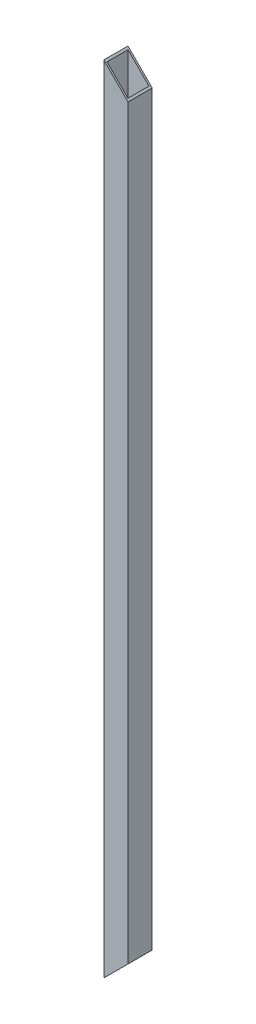
ISO-10303-21;
HEADER;
FILE_DESCRIPTION(('STEP AP214'),'2;1');
FILE_NAME('part.step','',(''),(''),'','','');
FILE_SCHEMA(('AUTOMOTIVE_DESIGN { 1 0 10303 214 1 1 1 1 }'));
ENDSEC;
DATA;
#1=APPLICATION_CONTEXT('core data for automotive mechanical design processes');
#2=APPLICATION_PROTOCOL_DEFINITION('international standard','automotive_design',2000,#1);
#3=PRODUCT_CONTEXT('',#1,'mechanical');
#4=PRODUCT('Part','Part','',(#3));
#5=PRODUCT_RELATED_PRODUCT_CATEGORY('part','',(#4));
#6=PRODUCT_DEFINITION_FORMATION('','',#4);
#7=PRODUCT_DEFINITION_CONTEXT('part definition',#1,'design');
#8=PRODUCT_DEFINITION('design','',#6,#7);
#9=PRODUCT_DEFINITION_SHAPE('','',#8);
#10=(LENGTH_UNIT() NAMED_UNIT(*) SI_UNIT(.MILLI.,.METRE.));
#11=(NAMED_UNIT(*) PLANE_ANGLE_UNIT() SI_UNIT($,.RADIAN.));
#12=(NAMED_UNIT(*) SI_UNIT($,.STERADIAN.) SOLID_ANGLE_UNIT());
#13=UNCERTAINTY_MEASURE_WITH_UNIT(LENGTH_MEASURE(1.E-05),#10,'distance_accuracy_value','');
#14=(GEOMETRIC_REPRESENTATION_CONTEXT(3) GLOBAL_UNCERTAINTY_ASSIGNED_CONTEXT((#13)) GLOBAL_UNIT_ASSIGNED_CONTEXT((#10,
#11,#12)) REPRESENTATION_CONTEXT('',''));
#15=CARTESIAN_POINT('',(0.,0.,0.));
#16=DIRECTION('',(0.,0.,1.));
#17=DIRECTION('',(1.,0.,0.));
#18=AXIS2_PLACEMENT_3D('',#15,#16,#17);
#19=CARTESIAN_POINT('',(19.,1247.47,-19.));
#20=DIRECTION('',(1.,0.,0.));
#21=DIRECTION('',(0.,0.,-1.));
#22=AXIS2_PLACEMENT_3D('',#19,#20,#21);
#23=PLANE('',#22);
#24=DIRECTION('',(0.,0.,1.));
#25=VECTOR('',#24,1.);
#26=CARTESIAN_POINT('',(19.,1209.47,-1229.62700631534));
#27=LINE('',#26,#25);
#28=CARTESIAN_POINT('',(19.,1209.47,-19.));
#29=VERTEX_POINT('',#28);
#30=CARTESIAN_POINT('',(19.,1209.47,19.));
#31=VERTEX_POINT('',#30);
#32=EDGE_CURVE('E97',#29,#31,#27,.T.);
#33=ORIENTED_EDGE('',*,*,#32,.T.);
#34=DIRECTION('',(0.,-1.,0.));
#35=VECTOR('',#34,1.);
#36=CARTESIAN_POINT('',(19.,1247.47,19.));
#37=LINE('',#36,#35);
#38=CARTESIAN_POINT('',(19.,38.,19.));
#39=VERTEX_POINT('',#38);
#40=EDGE_CURVE('E95',#31,#39,#37,.T.);
#41=ORIENTED_EDGE('',*,*,#40,.T.);
#42=DIRECTION('',(0.,0.,1.));
#43=VECTOR('',#42,1.);
#44=CARTESIAN_POINT('',(19.,38.,-1229.62700631534));
#45=LINE('',#44,#43);
#46=CARTESIAN_POINT('',(19.,38.,-19.));
#47=VERTEX_POINT('',#46);
#48=EDGE_CURVE('E137',#47,#39,#45,.T.);
#49=ORIENTED_EDGE('',*,*,#48,.F.);
#50=DIRECTION('',(0.,-1.,0.));
#51=VECTOR('',#50,1.);
#52=CARTESIAN_POINT('',(19.,1247.47,-19.));
#53=LINE('',#52,#51);
#54=EDGE_CURVE('E85',#29,#47,#53,.T.);
#55=ORIENTED_EDGE('',*,*,#54,.F.);
#56=EDGE_LOOP('',(#33,#41,#49,#55));
#57=FACE_BOUND('',#56,.T.);
#58=ADVANCED_FACE('F17',(#57),#23,.T.);
#59=CARTESIAN_POINT('',(19.,1247.47,19.));
#60=DIRECTION('',(0.,0.,1.));
#61=DIRECTION('',(1.,0.,0.));
#62=AXIS2_PLACEMENT_3D('',#59,#60,#61);
#63=PLANE('',#62);
#64=DIRECTION('',(0.707106781186547,-0.707106781186548,0.));
#65=VECTOR('',#64,1.);
#66=CARTESIAN_POINT('',(-19.,1247.47,19.));
#67=LINE('',#66,#65);
#68=CARTESIAN_POINT('',(-19.,1247.47,19.));
#69=VERTEX_POINT('',#68);
#70=EDGE_CURVE('E31',#69,#31,#67,.T.);
#71=ORIENTED_EDGE('',*,*,#70,.F.);
#72=DIRECTION('',(0.,-1.,0.));
#73=VECTOR('',#72,1.);
#74=CARTESIAN_POINT('',(-19.,1247.47,19.));
#75=LINE('',#74,#73);
#76=CARTESIAN_POINT('',(-19.,0.,19.));
#77=VERTEX_POINT('',#76);
#78=EDGE_CURVE('E93',#69,#77,#75,.T.);
#79=ORIENTED_EDGE('',*,*,#78,.T.);
#80=DIRECTION('',(0.707106781186547,0.707106781186548,0.));
#81=VECTOR('',#80,1.);
#82=CARTESIAN_POINT('',(-19.,0.,19.));
#83=LINE('',#82,#81);
#84=EDGE_CURVE('E134',#77,#39,#83,.T.);
#85=ORIENTED_EDGE('',*,*,#84,.T.);
#86=ORIENTED_EDGE('',*,*,#40,.F.);
#87=EDGE_LOOP('',(#71,#79,#85,#86));
#88=FACE_BOUND('',#87,.T.);
#89=ADVANCED_FACE('F91',(#88),#63,.T.);
#90=CARTESIAN_POINT('',(-19.,1247.47,-19.));
#91=DIRECTION('',(0.,0.,-1.));
#92=DIRECTION('',(-1.,0.,0.));
#93=AXIS2_PLACEMENT_3D('',#90,#91,#92);
#94=PLANE('',#93);
#95=DIRECTION('',(-0.707106781186547,0.707106781186548,0.));
#96=VECTOR('',#95,1.);
#97=CARTESIAN_POINT('',(-19.,1247.47,-19.));
#98=LINE('',#97,#96);
#99=CARTESIAN_POINT('',(-19.,1247.47,-19.));
#100=VERTEX_POINT('',#99);
#101=EDGE_CURVE('E80',#29,#100,#98,.T.);
#102=ORIENTED_EDGE('',*,*,#101,.F.);
#103=ORIENTED_EDGE('',*,*,#54,.T.);
#104=DIRECTION('',(-0.707106781186547,-0.707106781186548,0.));
#105=VECTOR('',#104,1.);
#106=CARTESIAN_POINT('',(604.735,623.735,-19.));
#107=LINE('',#106,#105);
#108=CARTESIAN_POINT('',(-19.,0.,-19.));
#109=VERTEX_POINT('',#108);
#110=EDGE_CURVE('E145',#47,#109,#107,.T.);
#111=ORIENTED_EDGE('',*,*,#110,.T.);
#112=DIRECTION('',(0.,-1.,0.));
#113=VECTOR('',#112,1.);
#114=CARTESIAN_POINT('',(-19.,1247.47,-19.));
#115=LINE('',#114,#113);
#116=EDGE_CURVE('E100',#100,#109,#115,.T.);
#117=ORIENTED_EDGE('',*,*,#116,.F.);
#118=EDGE_LOOP('',(#102,#103,#111,#117));
#119=FACE_BOUND('',#118,.T.);
#120=ADVANCED_FACE('F152',(#119),#94,.T.);
#121=CARTESIAN_POINT('',(-19.,1247.47,19.));
#122=DIRECTION('',(-1.,0.,0.));
#123=DIRECTION('',(0.,0.,1.));
#124=AXIS2_PLACEMENT_3D('',#121,#122,#123);
#125=PLANE('',#124);
#126=DIRECTION('',(0.,0.,-1.));
#127=VECTOR('',#126,1.);
#128=CARTESIAN_POINT('',(-19.,0.,19.));
#129=LINE('',#128,#127);
#130=EDGE_CURVE('E86',#77,#109,#129,.T.);
#131=ORIENTED_EDGE('',*,*,#130,.F.);
#132=ORIENTED_EDGE('',*,*,#78,.F.);
#133=DIRECTION('',(0.,0.,-1.));
#134=VECTOR('',#133,1.);
#135=CARTESIAN_POINT('',(-19.,1247.47,19.));
#136=LINE('',#135,#134);
#137=EDGE_CURVE('E77',#69,#100,#136,.T.);
#138=ORIENTED_EDGE('',*,*,#137,.T.);
#139=ORIENTED_EDGE('',*,*,#116,.T.);
#140=EDGE_LOOP('',(#131,#132,#138,#139));
#141=FACE_BOUND('',#140,.T.);
#142=ADVANCED_FACE('F99',(#141),#125,.T.);
#143=CARTESIAN_POINT('',(-19.,0.,-1229.62700631534));
#144=DIRECTION('',(0.707106781186548,-0.707106781186547,0.));
#145=DIRECTION('',(0.707106781186547,0.707106781186548,0.));
#146=AXIS2_PLACEMENT_3D('',#143,#144,#145);
#147=PLANE('',#146);
#148=DIRECTION('',(0.707106781186547,0.707106781186548,0.));
#149=VECTOR('',#148,1.);
#150=CARTESIAN_POINT('',(-19.,0.,-16.5));
#151=LINE('',#150,#149);
#152=CARTESIAN_POINT('',(-16.5,2.5,-16.5));
#153=VERTEX_POINT('',#152);
#154=CARTESIAN_POINT('',(16.5,35.5,-16.5));
#155=VERTEX_POINT('',#154);
#156=EDGE_CURVE('E24',#153,#155,#151,.T.);
#157=ORIENTED_EDGE('',*,*,#156,.F.);
#158=DIRECTION('',(0.,0.,-1.));
#159=VECTOR('',#158,1.);
#160=CARTESIAN_POINT('',(-16.5,2.5,-1229.62700631534));
#161=LINE('',#160,#159);
#162=CARTESIAN_POINT('',(-16.5,2.49999999999994,16.5));
#163=VERTEX_POINT('',#162);
#164=EDGE_CURVE('E102',#163,#153,#161,.T.);
#165=ORIENTED_EDGE('',*,*,#164,.F.);
#166=DIRECTION('',(-0.707106781186547,-0.707106781186548,0.));
#167=VECTOR('',#166,1.);
#168=CARTESIAN_POINT('',(-19.,0.,16.5));
#169=LINE('',#168,#167);
#170=CARTESIAN_POINT('',(16.5,35.5,16.5));
#171=VERTEX_POINT('',#170);
#172=EDGE_CURVE('E109',#171,#163,#169,.T.);
#173=ORIENTED_EDGE('',*,*,#172,.F.);
#174=DIRECTION('',(0.,0.,1.));
#175=VECTOR('',#174,1.);
#176=CARTESIAN_POINT('',(16.5,35.5,-1229.62700631534));
#177=LINE('',#176,#175);
#178=EDGE_CURVE('E112',#155,#171,#177,.T.);
#179=ORIENTED_EDGE('',*,*,#178,.F.);
#180=EDGE_LOOP('',(#157,#165,#173,#179));
#181=FACE_BOUND('',#180,.T.);
#182=ORIENTED_EDGE('',*,*,#48,.T.);
#183=ORIENTED_EDGE('',*,*,#84,.F.);
#184=ORIENTED_EDGE('',*,*,#130,.T.);
#185=ORIENTED_EDGE('',*,*,#110,.F.);
#186=EDGE_LOOP('',(#182,#183,#184,#185));
#187=FACE_BOUND('',#186,.T.);
#188=ADVANCED_FACE('F126',(#181,#187),#147,.T.);
#189=CARTESIAN_POINT('',(-16.5,1248.62700631534,-16.5));
#190=DIRECTION('',(0.,0.,-1.));
#191=DIRECTION('',(-1.,0.,0.));
#192=AXIS2_PLACEMENT_3D('',#189,#190,#191);
#193=PLANE('',#192);
#194=DIRECTION('',(0.,-1.,0.));
#195=VECTOR('',#194,1.);
#196=CARTESIAN_POINT('',(16.5,1248.62700631534,-16.5));
#197=LINE('',#196,#195);
#198=CARTESIAN_POINT('',(16.5,1211.97,-16.5));
#199=VERTEX_POINT('',#198);
#200=EDGE_CURVE('E120',#199,#155,#197,.T.);
#201=ORIENTED_EDGE('',*,*,#200,.F.);
#202=DIRECTION('',(-0.707106781186547,0.707106781186548,0.));
#203=VECTOR('',#202,1.);
#204=CARTESIAN_POINT('',(-18.3285031576684,1246.79850315767,-16.5));
#205=LINE('',#204,#203);
#206=CARTESIAN_POINT('',(-16.5,1244.97,-16.5));
#207=VERTEX_POINT('',#206);
#208=EDGE_CURVE('E161',#199,#207,#205,.T.);
#209=ORIENTED_EDGE('',*,*,#208,.T.);
#210=DIRECTION('',(0.,-1.,0.));
#211=VECTOR('',#210,1.);
#212=CARTESIAN_POINT('',(-16.5,1248.62700631534,-16.5));
#213=LINE('',#212,#211);
#214=EDGE_CURVE('E122',#207,#153,#213,.T.);
#215=ORIENTED_EDGE('',*,*,#214,.T.);
#216=ORIENTED_EDGE('',*,*,#156,.T.);
#217=EDGE_LOOP('',(#201,#209,#215,#216));
#218=FACE_BOUND('',#217,.T.);
#219=ADVANCED_FACE('F119',(#218),#193,.F.);
#220=CARTESIAN_POINT('',(16.5,1248.62700631534,-16.5));
#221=DIRECTION('',(1.,0.,0.));
#222=DIRECTION('',(0.,0.,-1.));
#223=AXIS2_PLACEMENT_3D('',#220,#221,#222);
#224=PLANE('',#223);
#225=DIRECTION('',(0.,-1.,0.));
#226=VECTOR('',#225,1.);
#227=CARTESIAN_POINT('',(16.5,1248.62700631534,16.5));
#228=LINE('',#227,#226);
#229=CARTESIAN_POINT('',(16.5,1211.97,16.5));
#230=VERTEX_POINT('',#229);
#231=EDGE_CURVE('E132',#230,#171,#228,.T.);
#232=ORIENTED_EDGE('',*,*,#231,.F.);
#233=DIRECTION('',(0.,0.,-1.));
#234=VECTOR('',#233,1.);
#235=CARTESIAN_POINT('',(16.5,1211.97,-16.5));
#236=LINE('',#235,#234);
#237=EDGE_CURVE('E133',#230,#199,#236,.T.);
#238=ORIENTED_EDGE('',*,*,#237,.T.);
#239=ORIENTED_EDGE('',*,*,#200,.T.);
#240=ORIENTED_EDGE('',*,*,#178,.T.);
#241=EDGE_LOOP('',(#232,#238,#239,#240));
#242=FACE_BOUND('',#241,.T.);
#243=ADVANCED_FACE('F130',(#242),#224,.F.);
#244=CARTESIAN_POINT('',(16.5,1248.62700631534,16.5));
#245=DIRECTION('',(0.,0.,1.));
#246=DIRECTION('',(1.,0.,0.));
#247=AXIS2_PLACEMENT_3D('',#244,#245,#246);
#248=PLANE('',#247);
#249=DIRECTION('',(0.,-1.,0.));
#250=VECTOR('',#249,1.);
#251=CARTESIAN_POINT('',(-16.5,1248.62700631534,16.5));
#252=LINE('',#251,#250);
#253=CARTESIAN_POINT('',(-16.5,1244.97,16.5));
#254=VERTEX_POINT('',#253);
#255=EDGE_CURVE('E139',#254,#163,#252,.T.);
#256=ORIENTED_EDGE('',*,*,#255,.F.);
#257=DIRECTION('',(0.707106781186547,-0.707106781186548,0.));
#258=VECTOR('',#257,1.);
#259=CARTESIAN_POINT('',(-1.8285031576684,1230.29850315767,16.5));
#260=LINE('',#259,#258);
#261=EDGE_CURVE('E155',#254,#230,#260,.T.);
#262=ORIENTED_EDGE('',*,*,#261,.T.);
#263=ORIENTED_EDGE('',*,*,#231,.T.);
#264=ORIENTED_EDGE('',*,*,#172,.T.);
#265=EDGE_LOOP('',(#256,#262,#263,#264));
#266=FACE_BOUND('',#265,.T.);
#267=ADVANCED_FACE('F168',(#266),#248,.F.);
#268=CARTESIAN_POINT('',(-16.5,1248.62700631534,16.5));
#269=DIRECTION('',(-1.,0.,0.));
#270=DIRECTION('',(0.,0.,1.));
#271=AXIS2_PLACEMENT_3D('',#268,#269,#270);
#272=PLANE('',#271);
#273=ORIENTED_EDGE('',*,*,#214,.F.);
#274=DIRECTION('',(0.,0.,1.));
#275=VECTOR('',#274,1.);
#276=CARTESIAN_POINT('',(-16.5,1244.97,16.5));
#277=LINE('',#276,#275);
#278=EDGE_CURVE('E11',#207,#254,#277,.T.);
#279=ORIENTED_EDGE('',*,*,#278,.T.);
#280=ORIENTED_EDGE('',*,*,#255,.T.);
#281=ORIENTED_EDGE('',*,*,#164,.T.);
#282=EDGE_LOOP('',(#273,#279,#280,#281));
#283=FACE_BOUND('',#282,.T.);
#284=ADVANCED_FACE('F166',(#283),#272,.F.);
#285=CARTESIAN_POINT('',(-19.,1247.47,-1229.62700631534));
#286=DIRECTION('',(-0.707106781186548,-0.707106781186547,0.));
#287=DIRECTION('',(0.707106781186547,-0.707106781186548,0.));
#288=AXIS2_PLACEMENT_3D('',#285,#286,#287);
#289=PLANE('',#288);
#290=ORIENTED_EDGE('',*,*,#237,.F.);
#291=ORIENTED_EDGE('',*,*,#261,.F.);
#292=ORIENTED_EDGE('',*,*,#278,.F.);
#293=ORIENTED_EDGE('',*,*,#208,.F.);
#294=EDGE_LOOP('',(#290,#291,#292,#293));
#295=FACE_BOUND('',#294,.T.);
#296=ORIENTED_EDGE('',*,*,#101,.T.);
#297=ORIENTED_EDGE('',*,*,#137,.F.);
#298=ORIENTED_EDGE('',*,*,#70,.T.);
#299=ORIENTED_EDGE('',*,*,#32,.F.);
#300=EDGE_LOOP('',(#296,#297,#298,#299));
#301=FACE_BOUND('',#300,.T.);
#302=ADVANCED_FACE('F78',(#295,#301),#289,.F.);
#303=CLOSED_SHELL('',(#58,#89,#120,#142,#188,#219,#243,#267,#284,#302));
#304=MANIFOLD_SOLID_BREP('B1',#303);
#305=ADVANCED_BREP_SHAPE_REPRESENTATION('',(#18,#304),#14);
#306=SHAPE_DEFINITION_REPRESENTATION(#9,#305);
ENDSEC;
END-ISO-10303-21;
